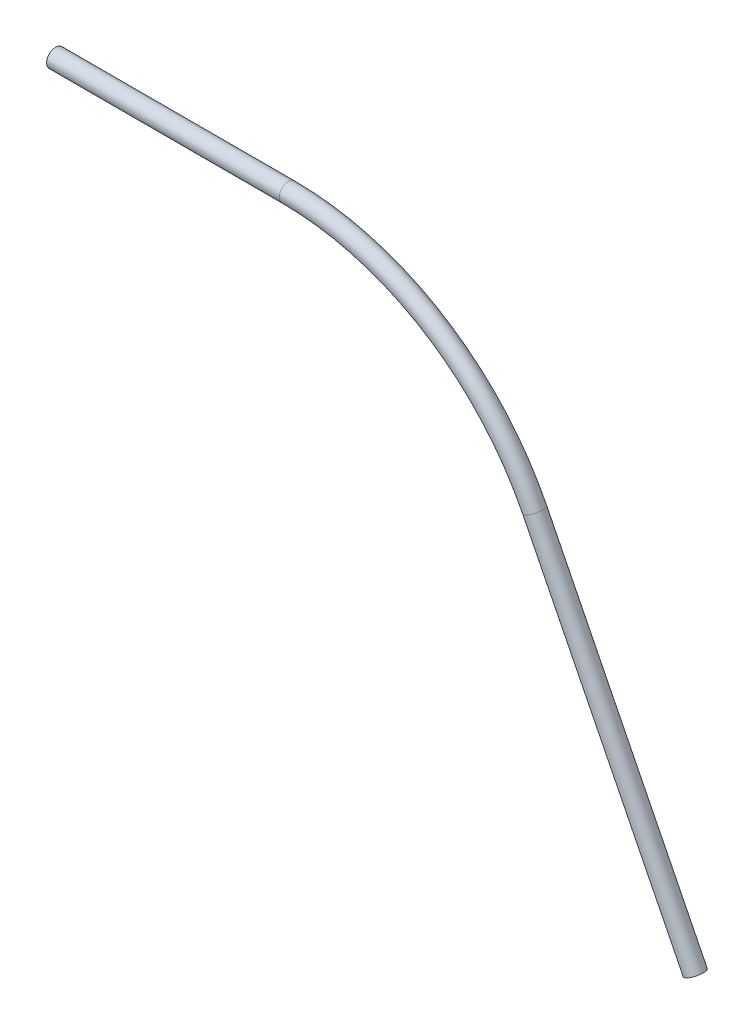
ISO-10303-21;
HEADER;
FILE_DESCRIPTION(('STEP AP214'),'2;1');
FILE_NAME('part.step','',(''),(''),'','','');
FILE_SCHEMA(('AUTOMOTIVE_DESIGN { 1 0 10303 214 1 1 1 1 }'));
ENDSEC;
DATA;
#1=APPLICATION_CONTEXT('core data for automotive mechanical design processes');
#2=APPLICATION_PROTOCOL_DEFINITION('international standard','automotive_design',2000,#1);
#3=PRODUCT_CONTEXT('',#1,'mechanical');
#4=PRODUCT('Part','Part','',(#3));
#5=PRODUCT_RELATED_PRODUCT_CATEGORY('part','',(#4));
#6=PRODUCT_DEFINITION_FORMATION('','',#4);
#7=PRODUCT_DEFINITION_CONTEXT('part definition',#1,'design');
#8=PRODUCT_DEFINITION('design','',#6,#7);
#9=PRODUCT_DEFINITION_SHAPE('','',#8);
#10=(LENGTH_UNIT() NAMED_UNIT(*) SI_UNIT(.MILLI.,.METRE.));
#11=(NAMED_UNIT(*) PLANE_ANGLE_UNIT() SI_UNIT($,.RADIAN.));
#12=(NAMED_UNIT(*) SI_UNIT($,.STERADIAN.) SOLID_ANGLE_UNIT());
#13=UNCERTAINTY_MEASURE_WITH_UNIT(LENGTH_MEASURE(1.E-05),#10,'distance_accuracy_value','');
#14=(GEOMETRIC_REPRESENTATION_CONTEXT(3) GLOBAL_UNCERTAINTY_ASSIGNED_CONTEXT((#13)) GLOBAL_UNIT_ASSIGNED_CONTEXT((#10,
#11,#12)) REPRESENTATION_CONTEXT('',''));
#15=CARTESIAN_POINT('',(0.,0.,0.));
#16=DIRECTION('',(0.,0.,1.));
#17=DIRECTION('',(1.,0.,0.));
#18=AXIS2_PLACEMENT_3D('',#15,#16,#17);
#19=CARTESIAN_POINT('',(33.0332707874449,-10.4902271323711,0.));
#20=DIRECTION('',(0.447882782506783,-0.894092284461723,0.));
#21=DIRECTION('',(0.894092284461723,0.447882782506783,0.));
#22=AXIS2_PLACEMENT_3D('',#19,#20,#21);
#23=CYLINDRICAL_SURFACE('',#22,0.62);
#24=CARTESIAN_POINT('',(33.0332707874449,-10.4902271323711,0.));
#25=DIRECTION('',(0.447882782506778,-0.894092284461725,0.));
#26=DIRECTION('',(0.,0.,-1.));
#27=AXIS2_PLACEMENT_3D('',#24,#25,#26);
#28=CIRCLE('',#27,0.62);
#29=CARTESIAN_POINT('',(33.5876080038111,-10.2125398072169,0.));
#30=VERTEX_POINT('',#29);
#31=EDGE_CURVE('E41',#30,#30,#28,.T.);
#32=ORIENTED_EDGE('',*,*,#31,.T.);
#33=EDGE_LOOP('',(#32));
#34=FACE_BOUND('',#33,.T.);
#35=CARTESIAN_POINT('',(44.1026714547696,-32.5876734215029,0.));
#36=DIRECTION('',(0.447882782506778,-0.894092284461725,0.));
#37=DIRECTION('',(0.,0.,-1.));
#38=AXIS2_PLACEMENT_3D('',#35,#36,#37);
#39=CIRCLE('',#38,0.62);
#40=CARTESIAN_POINT('',(44.1026714547696,-32.5876734215029,-0.62));
#41=VERTEX_POINT('',#40);
#42=EDGE_CURVE('E10',#41,#41,#39,.T.);
#43=ORIENTED_EDGE('',*,*,#42,.F.);
#44=EDGE_LOOP('',(#43));
#45=FACE_BOUND('',#44,.T.);
#46=ADVANCED_FACE('F31',(#34,#45),#23,.T.);
#47=CARTESIAN_POINT('',(33.0332707874449,-10.4902271323711,0.));
#48=DIRECTION('',(0.447882782506783,-0.894092284461723,0.));
#49=DIRECTION('',(0.894092284461723,0.447882782506783,0.));
#50=AXIS2_PLACEMENT_3D('',#47,#48,#49);
#51=CYLINDRICAL_SURFACE('',#50,0.498);
#52=CARTESIAN_POINT('',(33.0332707874449,-10.4902271323711,0.));
#53=DIRECTION('',(0.447882782506778,-0.894092284461725,0.));
#54=DIRECTION('',(0.,0.,-1.));
#55=AXIS2_PLACEMENT_3D('',#52,#53,#54);
#56=CIRCLE('',#55,0.498);
#57=CARTESIAN_POINT('',(33.4785287451068,-10.2671815066828,0.));
#58=VERTEX_POINT('',#57);
#59=EDGE_CURVE('E45',#58,#58,#56,.T.);
#60=ORIENTED_EDGE('',*,*,#59,.F.);
#61=EDGE_LOOP('',(#60));
#62=FACE_BOUND('',#61,.T.);
#63=CARTESIAN_POINT('',(44.1026714547696,-32.5876734215029,0.));
#64=DIRECTION('',(0.447882782506778,-0.894092284461725,0.));
#65=DIRECTION('',(0.,0.,-1.));
#66=AXIS2_PLACEMENT_3D('',#63,#64,#65);
#67=CIRCLE('',#66,0.498);
#68=CARTESIAN_POINT('',(44.1026714547696,-32.5876734215029,-0.498));
#69=VERTEX_POINT('',#68);
#70=EDGE_CURVE('E37',#69,#69,#67,.T.);
#71=ORIENTED_EDGE('',*,*,#70,.T.);
#72=EDGE_LOOP('',(#71));
#73=FACE_BOUND('',#72,.T.);
#74=ADVANCED_FACE('F73',(#62,#73),#51,.F.);
#75=CARTESIAN_POINT('',(16.0455173826721,-19.,0.));
#76=DIRECTION('',(0.,0.,-1.));
#77=DIRECTION('',(-1.,0.,0.));
#78=AXIS2_PLACEMENT_3D('',#75,#76,#77);
#79=TOROIDAL_SURFACE('',#78,19.,0.62);
#80=CARTESIAN_POINT('',(16.045517382672,0.,0.));
#81=DIRECTION('',(1.,0.,0.));
#82=DIRECTION('',(0.,0.,-1.));
#83=AXIS2_PLACEMENT_3D('',#80,#81,#82);
#84=CIRCLE('',#83,0.62);
#85=CARTESIAN_POINT('',(16.045517382672,0.619999999999999,0.));
#86=VERTEX_POINT('',#85);
#87=EDGE_CURVE('E50',#86,#86,#84,.T.);
#88=CARTESIAN_POINT('',(16.0455173826721,-19.,0.));
#89=DIRECTION('',(0.,0.,-1.));
#90=DIRECTION('',(-1.,0.,0.));
#91=AXIS2_PLACEMENT_3D('',#88,#89,#90);
#92=CIRCLE('',#91,19.62);
#93=EDGE_CURVE('',#86,#30,#92,.T.);
#94=ORIENTED_EDGE('',*,*,#87,.T.);
#95=ORIENTED_EDGE('',*,*,#31,.F.);
#96=ORIENTED_EDGE('',*,*,#93,.T.);
#97=ORIENTED_EDGE('',*,*,#93,.F.);
#98=EDGE_LOOP('',(#94,#96,#95,#97));
#99=FACE_BOUND('',#98,.T.);
#100=ADVANCED_FACE('F69',(#99),#79,.T.);
#101=CARTESIAN_POINT('',(16.0455173826721,-19.,0.));
#102=DIRECTION('',(0.,0.,-1.));
#103=DIRECTION('',(-1.,0.,0.));
#104=AXIS2_PLACEMENT_3D('',#101,#102,#103);
#105=TOROIDAL_SURFACE('',#104,19.,0.498);
#106=CARTESIAN_POINT('',(16.045517382672,0.,0.));
#107=DIRECTION('',(1.,0.,0.));
#108=DIRECTION('',(0.,0.,-1.));
#109=AXIS2_PLACEMENT_3D('',#106,#107,#108);
#110=CIRCLE('',#109,0.498);
#111=CARTESIAN_POINT('',(16.045517382672,0.497999999999998,0.));
#112=VERTEX_POINT('',#111);
#113=EDGE_CURVE('E54',#112,#112,#110,.T.);
#114=CARTESIAN_POINT('',(16.0455173826721,-19.,0.));
#115=DIRECTION('',(0.,0.,-1.));
#116=DIRECTION('',(-1.,0.,0.));
#117=AXIS2_PLACEMENT_3D('',#114,#115,#116);
#118=CIRCLE('',#117,19.498);
#119=EDGE_CURVE('',#112,#58,#118,.T.);
#120=ORIENTED_EDGE('',*,*,#113,.F.);
#121=ORIENTED_EDGE('',*,*,#59,.T.);
#122=ORIENTED_EDGE('',*,*,#119,.T.);
#123=ORIENTED_EDGE('',*,*,#119,.F.);
#124=EDGE_LOOP('',(#120,#122,#121,#123));
#125=FACE_BOUND('',#124,.T.);
#126=ADVANCED_FACE('F66',(#125),#105,.F.);
#127=CARTESIAN_POINT('',(16.045517382672,0.,0.));
#128=DIRECTION('',(-1.,0.,0.));
#129=DIRECTION('',(0.,0.,1.));
#130=AXIS2_PLACEMENT_3D('',#127,#128,#129);
#131=CYLINDRICAL_SURFACE('',#130,0.498);
#132=ORIENTED_EDGE('',*,*,#113,.T.);
#133=EDGE_LOOP('',(#132));
#134=FACE_BOUND('',#133,.T.);
#135=CARTESIAN_POINT('',(0.,0.,0.));
#136=DIRECTION('',(1.,0.,0.));
#137=DIRECTION('',(0.,0.,-1.));
#138=AXIS2_PLACEMENT_3D('',#135,#136,#137);
#139=CIRCLE('',#138,0.498);
#140=CARTESIAN_POINT('',(0.,0.,-0.498));
#141=VERTEX_POINT('',#140);
#142=EDGE_CURVE('E55',#141,#141,#139,.T.);
#143=ORIENTED_EDGE('',*,*,#142,.F.);
#144=EDGE_LOOP('',(#143));
#145=FACE_BOUND('',#144,.T.);
#146=ADVANCED_FACE('F63',(#134,#145),#131,.F.);
#147=CARTESIAN_POINT('',(16.045517382672,0.,0.));
#148=DIRECTION('',(-1.,0.,0.));
#149=DIRECTION('',(0.,0.,1.));
#150=AXIS2_PLACEMENT_3D('',#147,#148,#149);
#151=CYLINDRICAL_SURFACE('',#150,0.62);
#152=ORIENTED_EDGE('',*,*,#87,.F.);
#153=EDGE_LOOP('',(#152));
#154=FACE_BOUND('',#153,.T.);
#155=CARTESIAN_POINT('',(0.,0.,0.));
#156=DIRECTION('',(1.,0.,0.));
#157=DIRECTION('',(0.,0.,-1.));
#158=AXIS2_PLACEMENT_3D('',#155,#156,#157);
#159=CIRCLE('',#158,0.62);
#160=CARTESIAN_POINT('',(0.,0.,-0.62));
#161=VERTEX_POINT('',#160);
#162=EDGE_CURVE('E51',#161,#161,#159,.T.);
#163=ORIENTED_EDGE('',*,*,#162,.T.);
#164=EDGE_LOOP('',(#163));
#165=FACE_BOUND('',#164,.T.);
#166=ADVANCED_FACE('F85',(#154,#165),#151,.T.);
#167=CARTESIAN_POINT('',(44.1026714547696,-32.5876734215029,0.));
#168=DIRECTION('',(0.447882782506778,-0.894092284461725,0.));
#169=DIRECTION('',(0.,0.,-1.));
#170=AXIS2_PLACEMENT_3D('',#167,#168,#169);
#171=PLANE('',#170);
#172=ORIENTED_EDGE('',*,*,#70,.F.);
#173=EDGE_LOOP('',(#172));
#174=FACE_BOUND('',#173,.T.);
#175=ORIENTED_EDGE('',*,*,#42,.T.);
#176=EDGE_LOOP('',(#175));
#177=FACE_BOUND('',#176,.T.);
#178=ADVANCED_FACE('F88',(#174,#177),#171,.T.);
#179=CARTESIAN_POINT('',(0.,0.,0.));
#180=DIRECTION('',(1.,0.,0.));
#181=DIRECTION('',(0.,0.,-1.));
#182=AXIS2_PLACEMENT_3D('',#179,#180,#181);
#183=PLANE('',#182);
#184=ORIENTED_EDGE('',*,*,#142,.T.);
#185=EDGE_LOOP('',(#184));
#186=FACE_BOUND('',#185,.T.);
#187=ORIENTED_EDGE('',*,*,#162,.F.);
#188=EDGE_LOOP('',(#187));
#189=FACE_BOUND('',#188,.T.);
#190=ADVANCED_FACE('F90',(#186,#189),#183,.F.);
#191=CLOSED_SHELL('',(#46,#74,#100,#126,#146,#166,#178,#190));
#192=MANIFOLD_SOLID_BREP('B2',#191);
#193=ADVANCED_BREP_SHAPE_REPRESENTATION('',(#18,#192),#14);
#194=SHAPE_DEFINITION_REPRESENTATION(#9,#193);
ENDSEC;
END-ISO-10303-21;
